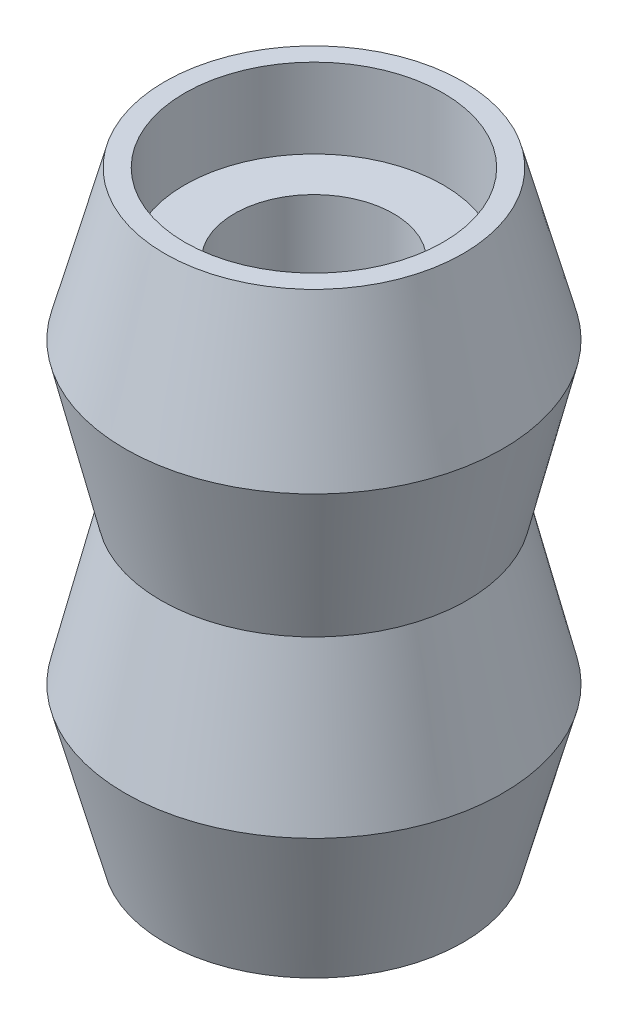
ISO-10303-21;
HEADER;
FILE_DESCRIPTION(('STEP AP214'),'2;1');
FILE_NAME('part.step','',(''),(''),'','','');
FILE_SCHEMA(('AUTOMOTIVE_DESIGN { 1 0 10303 214 1 1 1 1 }'));
ENDSEC;
DATA;
#1=APPLICATION_CONTEXT('core data for automotive mechanical design processes');
#2=APPLICATION_PROTOCOL_DEFINITION('international standard','automotive_design',2000,#1);
#3=PRODUCT_CONTEXT('',#1,'mechanical');
#4=PRODUCT('Part','Part','',(#3));
#5=PRODUCT_RELATED_PRODUCT_CATEGORY('part','',(#4));
#6=PRODUCT_DEFINITION_FORMATION('','',#4);
#7=PRODUCT_DEFINITION_CONTEXT('part definition',#1,'design');
#8=PRODUCT_DEFINITION('design','',#6,#7);
#9=PRODUCT_DEFINITION_SHAPE('','',#8);
#10=(LENGTH_UNIT() NAMED_UNIT(*) SI_UNIT(.MILLI.,.METRE.));
#11=(NAMED_UNIT(*) PLANE_ANGLE_UNIT() SI_UNIT($,.RADIAN.));
#12=(NAMED_UNIT(*) SI_UNIT($,.STERADIAN.) SOLID_ANGLE_UNIT());
#13=UNCERTAINTY_MEASURE_WITH_UNIT(LENGTH_MEASURE(1.E-05),#10,'distance_accuracy_value','');
#14=(GEOMETRIC_REPRESENTATION_CONTEXT(3) GLOBAL_UNCERTAINTY_ASSIGNED_CONTEXT((#13)) GLOBAL_UNIT_ASSIGNED_CONTEXT((#10,
#11,#12)) REPRESENTATION_CONTEXT('',''));
#15=CARTESIAN_POINT('',(0.,0.,0.));
#16=DIRECTION('',(0.,0.,1.));
#17=DIRECTION('',(1.,0.,0.));
#18=AXIS2_PLACEMENT_3D('',#15,#16,#17);
#19=CARTESIAN_POINT('',(0.,-11.8076832184088,0.));
#20=DIRECTION('',(0.,1.,0.));
#21=DIRECTION('',(0.,0.,1.));
#22=AXIS2_PLACEMENT_3D('',#19,#20,#21);
#23=CONICAL_SURFACE('',#22,7.5,0.260602391747341);
#24=CARTESIAN_POINT('',(0.,-4.30768321840881,0.));
#25=DIRECTION('',(0.,1.,0.));
#26=DIRECTION('',(0.,0.,1.));
#27=AXIS2_PLACEMENT_3D('',#24,#25,#26);
#28=CIRCLE('',#27,9.5);
#29=CARTESIAN_POINT('',(0.,-4.30768321840881,9.5));
#30=VERTEX_POINT('',#29);
#31=EDGE_CURVE('E68',#30,#30,#28,.T.);
#32=ORIENTED_EDGE('',*,*,#31,.F.);
#33=EDGE_LOOP('',(#32));
#34=FACE_BOUND('',#33,.T.);
#35=CARTESIAN_POINT('',(0.,-11.8076832184088,0.));
#36=DIRECTION('',(0.,1.,0.));
#37=DIRECTION('',(0.,0.,1.));
#38=AXIS2_PLACEMENT_3D('',#35,#36,#37);
#39=CIRCLE('',#38,7.5);
#40=CARTESIAN_POINT('',(0.,-11.8076832184088,7.5));
#41=VERTEX_POINT('',#40);
#42=EDGE_CURVE('E10',#41,#41,#39,.T.);
#43=ORIENTED_EDGE('',*,*,#42,.T.);
#44=EDGE_LOOP('',(#43));
#45=FACE_BOUND('',#44,.T.);
#46=ADVANCED_FACE('F31',(#34,#45),#23,.T.);
#47=CARTESIAN_POINT('',(6.5,-11.8076832184088,0.));
#48=DIRECTION('',(0.,1.,0.));
#49=DIRECTION('',(0.,0.,1.));
#50=AXIS2_PLACEMENT_3D('',#47,#48,#49);
#51=PLANE('',#50);
#52=ORIENTED_EDGE('',*,*,#42,.F.);
#53=EDGE_LOOP('',(#52));
#54=FACE_BOUND('',#53,.T.);
#55=CARTESIAN_POINT('',(0.,-11.8076832184088,0.));
#56=DIRECTION('',(0.,1.,0.));
#57=DIRECTION('',(0.,0.,1.));
#58=AXIS2_PLACEMENT_3D('',#55,#56,#57);
#59=CIRCLE('',#58,6.5);
#60=CARTESIAN_POINT('',(0.,-11.8076832184088,6.5));
#61=VERTEX_POINT('',#60);
#62=EDGE_CURVE('E37',#61,#61,#59,.T.);
#63=ORIENTED_EDGE('',*,*,#62,.T.);
#64=EDGE_LOOP('',(#63));
#65=FACE_BOUND('',#64,.T.);
#66=ADVANCED_FACE('F75',(#54,#65),#51,.F.);
#67=CARTESIAN_POINT('',(0.,42.3234558477177,0.));
#68=DIRECTION('',(0.,1.,0.));
#69=DIRECTION('',(0.,0.,1.));
#70=AXIS2_PLACEMENT_3D('',#67,#68,#69);
#71=CYLINDRICAL_SURFACE('',#70,6.5);
#72=ORIENTED_EDGE('',*,*,#62,.F.);
#73=EDGE_LOOP('',(#72));
#74=FACE_BOUND('',#73,.T.);
#75=CARTESIAN_POINT('',(0.,-7.80768321840881,0.));
#76=DIRECTION('',(0.,1.,0.));
#77=DIRECTION('',(0.,0.,1.));
#78=AXIS2_PLACEMENT_3D('',#75,#76,#77);
#79=CIRCLE('',#78,6.5);
#80=CARTESIAN_POINT('',(0.,-7.80768321840881,6.5));
#81=VERTEX_POINT('',#80);
#82=EDGE_CURVE('E41',#81,#81,#79,.T.);
#83=ORIENTED_EDGE('',*,*,#82,.T.);
#84=EDGE_LOOP('',(#83));
#85=FACE_BOUND('',#84,.T.);
#86=ADVANCED_FACE('F79',(#74,#85),#71,.F.);
#87=CARTESIAN_POINT('',(4.,-7.80768321840881,0.));
#88=DIRECTION('',(0.,1.,0.));
#89=DIRECTION('',(0.,0.,1.));
#90=AXIS2_PLACEMENT_3D('',#87,#88,#89);
#91=PLANE('',#90);
#92=ORIENTED_EDGE('',*,*,#82,.F.);
#93=EDGE_LOOP('',(#92));
#94=FACE_BOUND('',#93,.T.);
#95=CARTESIAN_POINT('',(0.,-7.80768321840881,0.));
#96=DIRECTION('',(0.,1.,0.));
#97=DIRECTION('',(0.,0.,1.));
#98=AXIS2_PLACEMENT_3D('',#95,#96,#97);
#99=CIRCLE('',#98,4.);
#100=CARTESIAN_POINT('',(0.,-7.80768321840881,4.));
#101=VERTEX_POINT('',#100);
#102=EDGE_CURVE('E45',#101,#101,#99,.T.);
#103=ORIENTED_EDGE('',*,*,#102,.T.);
#104=EDGE_LOOP('',(#103));
#105=FACE_BOUND('',#104,.T.);
#106=ADVANCED_FACE('F84',(#94,#105),#91,.F.);
#107=CARTESIAN_POINT('',(0.,42.3234558477177,0.));
#108=DIRECTION('',(0.,1.,0.));
#109=DIRECTION('',(0.,0.,1.));
#110=AXIS2_PLACEMENT_3D('',#107,#108,#109);
#111=CYLINDRICAL_SURFACE('',#110,4.);
#112=ORIENTED_EDGE('',*,*,#102,.F.);
#113=EDGE_LOOP('',(#112));
#114=FACE_BOUND('',#113,.T.);
#115=CARTESIAN_POINT('',(0.,14.1923167815912,0.));
#116=DIRECTION('',(0.,1.,0.));
#117=DIRECTION('',(0.,0.,1.));
#118=AXIS2_PLACEMENT_3D('',#115,#116,#117);
#119=CIRCLE('',#118,4.);
#120=CARTESIAN_POINT('',(0.,14.1923167815912,4.));
#121=VERTEX_POINT('',#120);
#122=EDGE_CURVE('E50',#121,#121,#119,.T.);
#123=ORIENTED_EDGE('',*,*,#122,.T.);
#124=EDGE_LOOP('',(#123));
#125=FACE_BOUND('',#124,.T.);
#126=ADVANCED_FACE('F90',(#114,#125),#111,.F.);
#127=CARTESIAN_POINT('',(4.,14.1923167815912,0.));
#128=DIRECTION('',(0.,-1.,0.));
#129=DIRECTION('',(0.,0.,-1.));
#130=AXIS2_PLACEMENT_3D('',#127,#128,#129);
#131=PLANE('',#130);
#132=ORIENTED_EDGE('',*,*,#122,.F.);
#133=EDGE_LOOP('',(#132));
#134=FACE_BOUND('',#133,.T.);
#135=CARTESIAN_POINT('',(0.,14.1923167815912,0.));
#136=DIRECTION('',(0.,1.,0.));
#137=DIRECTION('',(0.,0.,1.));
#138=AXIS2_PLACEMENT_3D('',#135,#136,#137);
#139=CIRCLE('',#138,6.5);
#140=CARTESIAN_POINT('',(0.,14.1923167815912,6.5));
#141=VERTEX_POINT('',#140);
#142=EDGE_CURVE('E53',#141,#141,#139,.T.);
#143=ORIENTED_EDGE('',*,*,#142,.T.);
#144=EDGE_LOOP('',(#143));
#145=FACE_BOUND('',#144,.T.);
#146=ADVANCED_FACE('F94',(#134,#145),#131,.F.);
#147=CARTESIAN_POINT('',(0.,42.3234558477177,0.));
#148=DIRECTION('',(0.,1.,0.));
#149=DIRECTION('',(0.,0.,1.));
#150=AXIS2_PLACEMENT_3D('',#147,#148,#149);
#151=CYLINDRICAL_SURFACE('',#150,6.5);
#152=ORIENTED_EDGE('',*,*,#142,.F.);
#153=EDGE_LOOP('',(#152));
#154=FACE_BOUND('',#153,.T.);
#155=CARTESIAN_POINT('',(0.,18.1923167815912,0.));
#156=DIRECTION('',(0.,1.,0.));
#157=DIRECTION('',(0.,0.,1.));
#158=AXIS2_PLACEMENT_3D('',#155,#156,#157);
#159=CIRCLE('',#158,6.5);
#160=CARTESIAN_POINT('',(0.,18.1923167815912,6.5));
#161=VERTEX_POINT('',#160);
#162=EDGE_CURVE('E56',#161,#161,#159,.T.);
#163=ORIENTED_EDGE('',*,*,#162,.T.);
#164=EDGE_LOOP('',(#163));
#165=FACE_BOUND('',#164,.T.);
#166=ADVANCED_FACE('F98',(#154,#165),#151,.F.);
#167=CARTESIAN_POINT('',(6.5,18.1923167815912,0.));
#168=DIRECTION('',(0.,-1.,0.));
#169=DIRECTION('',(0.,0.,-1.));
#170=AXIS2_PLACEMENT_3D('',#167,#168,#169);
#171=PLANE('',#170);
#172=ORIENTED_EDGE('',*,*,#162,.F.);
#173=EDGE_LOOP('',(#172));
#174=FACE_BOUND('',#173,.T.);
#175=CARTESIAN_POINT('',(0.,18.1923167815912,0.));
#176=DIRECTION('',(0.,1.,0.));
#177=DIRECTION('',(0.,0.,1.));
#178=AXIS2_PLACEMENT_3D('',#175,#176,#177);
#179=CIRCLE('',#178,7.5);
#180=CARTESIAN_POINT('',(0.,18.1923167815912,7.5));
#181=VERTEX_POINT('',#180);
#182=EDGE_CURVE('E59',#181,#181,#179,.T.);
#183=ORIENTED_EDGE('',*,*,#182,.T.);
#184=EDGE_LOOP('',(#183));
#185=FACE_BOUND('',#184,.T.);
#186=ADVANCED_FACE('F102',(#174,#185),#171,.F.);
#187=CARTESIAN_POINT('',(0.,10.6923167815912,0.));
#188=DIRECTION('',(0.,-1.,0.));
#189=DIRECTION('',(0.,0.,-1.));
#190=AXIS2_PLACEMENT_3D('',#187,#188,#189);
#191=CONICAL_SURFACE('',#190,9.5,0.260602391747341);
#192=ORIENTED_EDGE('',*,*,#182,.F.);
#193=EDGE_LOOP('',(#192));
#194=FACE_BOUND('',#193,.T.);
#195=CARTESIAN_POINT('',(0.,10.6923167815912,0.));
#196=DIRECTION('',(0.,1.,0.));
#197=DIRECTION('',(0.,0.,1.));
#198=AXIS2_PLACEMENT_3D('',#195,#196,#197);
#199=CIRCLE('',#198,9.5);
#200=CARTESIAN_POINT('',(0.,10.6923167815912,9.5));
#201=VERTEX_POINT('',#200);
#202=EDGE_CURVE('E62',#201,#201,#199,.T.);
#203=ORIENTED_EDGE('',*,*,#202,.T.);
#204=EDGE_LOOP('',(#203));
#205=FACE_BOUND('',#204,.T.);
#206=ADVANCED_FACE('F106',(#194,#205),#191,.T.);
#207=CARTESIAN_POINT('',(0.,3.19231678159119,0.));
#208=DIRECTION('',(0.,1.,0.));
#209=DIRECTION('',(0.,0.,1.));
#210=AXIS2_PLACEMENT_3D('',#207,#208,#209);
#211=CONICAL_SURFACE('',#210,7.7,0.235544980720863);
#212=ORIENTED_EDGE('',*,*,#202,.F.);
#213=EDGE_LOOP('',(#212));
#214=FACE_BOUND('',#213,.T.);
#215=CARTESIAN_POINT('',(0.,3.19231678159119,0.));
#216=DIRECTION('',(0.,1.,0.));
#217=DIRECTION('',(0.,0.,1.));
#218=AXIS2_PLACEMENT_3D('',#215,#216,#217);
#219=CIRCLE('',#218,7.7);
#220=CARTESIAN_POINT('',(0.,3.19231678159119,7.7));
#221=VERTEX_POINT('',#220);
#222=EDGE_CURVE('E65',#221,#221,#219,.T.);
#223=ORIENTED_EDGE('',*,*,#222,.T.);
#224=EDGE_LOOP('',(#223));
#225=FACE_BOUND('',#224,.T.);
#226=ADVANCED_FACE('F110',(#214,#225),#211,.T.);
#227=CARTESIAN_POINT('',(0.,-4.30768321840881,0.));
#228=DIRECTION('',(0.,-1.,0.));
#229=DIRECTION('',(0.,0.,-1.));
#230=AXIS2_PLACEMENT_3D('',#227,#228,#229);
#231=CONICAL_SURFACE('',#230,9.5,0.235544980720863);
#232=ORIENTED_EDGE('',*,*,#222,.F.);
#233=EDGE_LOOP('',(#232));
#234=FACE_BOUND('',#233,.T.);
#235=ORIENTED_EDGE('',*,*,#31,.T.);
#236=EDGE_LOOP('',(#235));
#237=FACE_BOUND('',#236,.T.);
#238=ADVANCED_FACE('F72',(#234,#237),#231,.T.);
#239=CLOSED_SHELL('',(#46,#66,#86,#106,#126,#146,#166,#186,#206,#226,#238));
#240=MANIFOLD_SOLID_BREP('B2',#239);
#241=ADVANCED_BREP_SHAPE_REPRESENTATION('',(#18,#240),#14);
#242=SHAPE_DEFINITION_REPRESENTATION(#9,#241);
ENDSEC;
END-ISO-10303-21;
